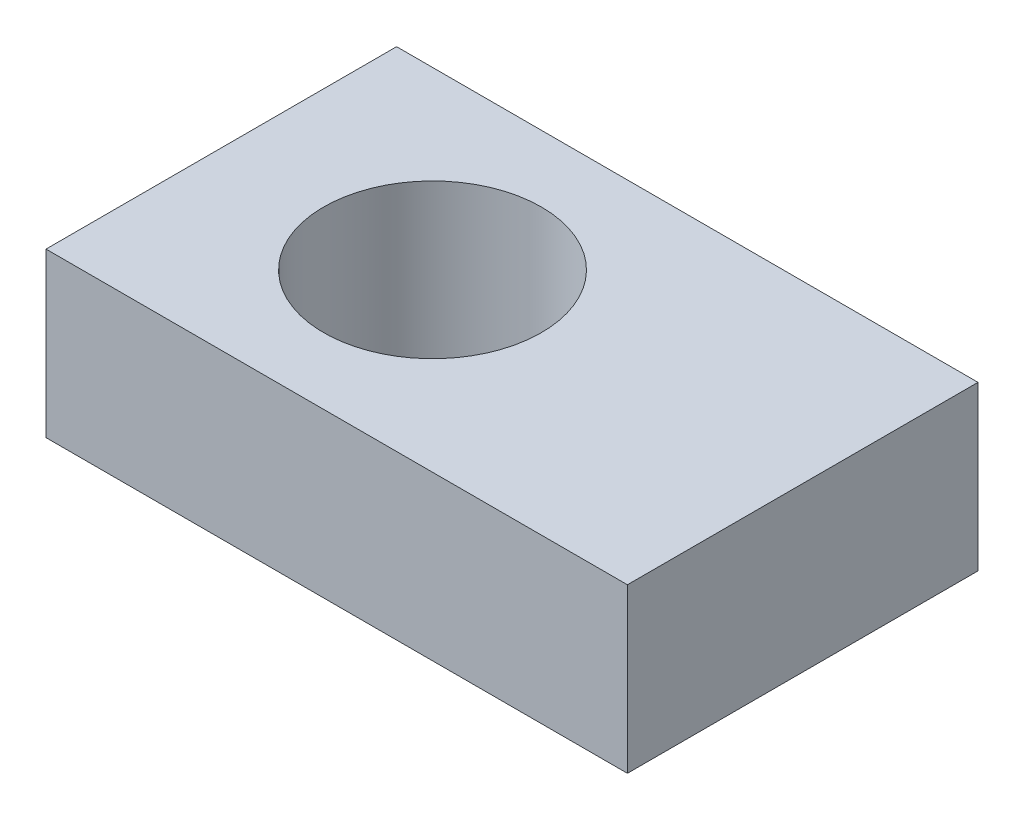
ISO-10303-21;
HEADER;
FILE_DESCRIPTION(('STEP AP214'),'2;1');
FILE_NAME('part.step','',(''),(''),'','','');
FILE_SCHEMA(('AUTOMOTIVE_DESIGN { 1 0 10303 214 1 1 1 1 }'));
ENDSEC;
DATA;
#1=APPLICATION_CONTEXT('core data for automotive mechanical design processes');
#2=APPLICATION_PROTOCOL_DEFINITION('international standard','automotive_design',2000,#1);
#3=PRODUCT_CONTEXT('',#1,'mechanical');
#4=PRODUCT('Part','Part','',(#3));
#5=PRODUCT_RELATED_PRODUCT_CATEGORY('part','',(#4));
#6=PRODUCT_DEFINITION_FORMATION('','',#4);
#7=PRODUCT_DEFINITION_CONTEXT('part definition',#1,'design');
#8=PRODUCT_DEFINITION('design','',#6,#7);
#9=PRODUCT_DEFINITION_SHAPE('','',#8);
#10=(LENGTH_UNIT() NAMED_UNIT(*) SI_UNIT(.MILLI.,.METRE.));
#11=(NAMED_UNIT(*) PLANE_ANGLE_UNIT() SI_UNIT($,.RADIAN.));
#12=(NAMED_UNIT(*) SI_UNIT($,.STERADIAN.) SOLID_ANGLE_UNIT());
#13=UNCERTAINTY_MEASURE_WITH_UNIT(LENGTH_MEASURE(1.E-05),#10,'distance_accuracy_value','');
#14=(GEOMETRIC_REPRESENTATION_CONTEXT(3) GLOBAL_UNCERTAINTY_ASSIGNED_CONTEXT((#13)) GLOBAL_UNIT_ASSIGNED_CONTEXT((#10,
#11,#12)) REPRESENTATION_CONTEXT('',''));
#15=CARTESIAN_POINT('',(0.,0.,0.));
#16=DIRECTION('',(0.,0.,1.));
#17=DIRECTION('',(1.,0.,0.));
#18=AXIS2_PLACEMENT_3D('',#15,#16,#17);
#19=CARTESIAN_POINT('',(34.43,0.02,12.38));
#20=DIRECTION('',(0.,-1.,0.));
#21=DIRECTION('',(0.,0.,-1.));
#22=AXIS2_PLACEMENT_3D('',#19,#20,#21);
#23=PLANE('',#22);
#24=CARTESIAN_POINT('',(33.7,0.0200000000000001,12.38));
#25=DIRECTION('',(0.,-1.,0.));
#26=DIRECTION('',(0.,0.,-1.));
#27=AXIS2_PLACEMENT_3D('',#24,#25,#26);
#28=CIRCLE('',#27,1.);
#29=CARTESIAN_POINT('',(33.7,0.0200000000000001,11.38));
#30=VERTEX_POINT('',#29);
#31=EDGE_CURVE('E20',#30,#30,#28,.F.);
#32=ORIENTED_EDGE('',*,*,#31,.T.);
#33=EDGE_LOOP('',(#32));
#34=FACE_BOUND('',#33,.T.);
#35=DIRECTION('',(-1.,0.,0.));
#36=VECTOR('',#35,1.);
#37=CARTESIAN_POINT('',(31.76,0.0200000000000001,10.77));
#38=LINE('',#37,#36);
#39=CARTESIAN_POINT('',(37.1,0.02,10.77));
#40=VERTEX_POINT('',#39);
#41=CARTESIAN_POINT('',(31.76,0.02,10.77));
#42=VERTEX_POINT('',#41);
#43=EDGE_CURVE('E69',#40,#42,#38,.T.);
#44=ORIENTED_EDGE('',*,*,#43,.F.);
#45=DIRECTION('',(0.,0.,-1.));
#46=VECTOR('',#45,1.);
#47=CARTESIAN_POINT('',(37.1,0.0200000000000001,10.77));
#48=LINE('',#47,#46);
#49=CARTESIAN_POINT('',(37.1,0.02,13.99));
#50=VERTEX_POINT('',#49);
#51=EDGE_CURVE('E54',#50,#40,#48,.T.);
#52=ORIENTED_EDGE('',*,*,#51,.F.);
#53=DIRECTION('',(1.,0.,0.));
#54=VECTOR('',#53,1.);
#55=CARTESIAN_POINT('',(37.1,0.0200000000000001,13.99));
#56=LINE('',#55,#54);
#57=CARTESIAN_POINT('',(31.76,0.02,13.99));
#58=VERTEX_POINT('',#57);
#59=EDGE_CURVE('E59',#58,#50,#56,.T.);
#60=ORIENTED_EDGE('',*,*,#59,.F.);
#61=DIRECTION('',(0.,0.,1.));
#62=VECTOR('',#61,1.);
#63=CARTESIAN_POINT('',(31.76,0.0200000000000001,13.99));
#64=LINE('',#63,#62);
#65=EDGE_CURVE('E82',#42,#58,#64,.T.);
#66=ORIENTED_EDGE('',*,*,#65,.F.);
#67=EDGE_LOOP('',(#44,#52,#60,#66));
#68=FACE_BOUND('',#67,.T.);
#69=ADVANCED_FACE('F17',(#34,#68),#23,.T.);
#70=CARTESIAN_POINT('',(37.1,1.52,13.99));
#71=DIRECTION('',(0.,0.,1.));
#72=DIRECTION('',(1.,0.,0.));
#73=AXIS2_PLACEMENT_3D('',#70,#71,#72);
#74=PLANE('',#73);
#75=ORIENTED_EDGE('',*,*,#59,.T.);
#76=DIRECTION('',(0.,1.,0.));
#77=VECTOR('',#76,1.);
#78=CARTESIAN_POINT('',(37.1,1.52,13.99));
#79=LINE('',#78,#77);
#80=CARTESIAN_POINT('',(37.1,1.52,13.99));
#81=VERTEX_POINT('',#80);
#82=EDGE_CURVE('E61',#81,#50,#79,.F.);
#83=ORIENTED_EDGE('',*,*,#82,.F.);
#84=DIRECTION('',(1.,0.,0.));
#85=VECTOR('',#84,1.);
#86=CARTESIAN_POINT('',(34.43,1.52,13.99));
#87=LINE('',#86,#85);
#88=CARTESIAN_POINT('',(31.76,1.52,13.99));
#89=VERTEX_POINT('',#88);
#90=EDGE_CURVE('E85',#89,#81,#87,.T.);
#91=ORIENTED_EDGE('',*,*,#90,.F.);
#92=DIRECTION('',(0.,1.,0.));
#93=VECTOR('',#92,1.);
#94=CARTESIAN_POINT('',(31.76,1.52,13.99));
#95=LINE('',#94,#93);
#96=EDGE_CURVE('E64',#58,#89,#95,.T.);
#97=ORIENTED_EDGE('',*,*,#96,.F.);
#98=EDGE_LOOP('',(#75,#83,#91,#97));
#99=FACE_BOUND('',#98,.T.);
#100=ADVANCED_FACE('F60',(#99),#74,.T.);
#101=CARTESIAN_POINT('',(37.1,1.52,10.77));
#102=DIRECTION('',(1.,0.,0.));
#103=DIRECTION('',(0.,0.,-1.));
#104=AXIS2_PLACEMENT_3D('',#101,#102,#103);
#105=PLANE('',#104);
#106=ORIENTED_EDGE('',*,*,#51,.T.);
#107=DIRECTION('',(0.,1.,0.));
#108=VECTOR('',#107,1.);
#109=CARTESIAN_POINT('',(37.1,1.52,10.77));
#110=LINE('',#109,#108);
#111=CARTESIAN_POINT('',(37.1,1.52,10.77));
#112=VERTEX_POINT('',#111);
#113=EDGE_CURVE('E71',#112,#40,#110,.F.);
#114=ORIENTED_EDGE('',*,*,#113,.F.);
#115=DIRECTION('',(0.,0.,1.));
#116=VECTOR('',#115,1.);
#117=CARTESIAN_POINT('',(37.1,1.52,12.38));
#118=LINE('',#117,#116);
#119=EDGE_CURVE('E75',#81,#112,#118,.F.);
#120=ORIENTED_EDGE('',*,*,#119,.F.);
#121=ORIENTED_EDGE('',*,*,#82,.T.);
#122=EDGE_LOOP('',(#106,#114,#120,#121));
#123=FACE_BOUND('',#122,.T.);
#124=ADVANCED_FACE('F73',(#123),#105,.T.);
#125=CARTESIAN_POINT('',(31.76,1.52,10.77));
#126=DIRECTION('',(0.,0.,-1.));
#127=DIRECTION('',(-1.,0.,0.));
#128=AXIS2_PLACEMENT_3D('',#125,#126,#127);
#129=PLANE('',#128);
#130=ORIENTED_EDGE('',*,*,#43,.T.);
#131=DIRECTION('',(0.,1.,0.));
#132=VECTOR('',#131,1.);
#133=CARTESIAN_POINT('',(31.76,1.52,10.77));
#134=LINE('',#133,#132);
#135=CARTESIAN_POINT('',(31.76,1.52,10.77));
#136=VERTEX_POINT('',#135);
#137=EDGE_CURVE('E34',#136,#42,#134,.F.);
#138=ORIENTED_EDGE('',*,*,#137,.F.);
#139=DIRECTION('',(1.,0.,0.));
#140=VECTOR('',#139,1.);
#141=CARTESIAN_POINT('',(34.43,1.52,10.77));
#142=LINE('',#141,#140);
#143=EDGE_CURVE('E88',#112,#136,#142,.F.);
#144=ORIENTED_EDGE('',*,*,#143,.F.);
#145=ORIENTED_EDGE('',*,*,#113,.T.);
#146=EDGE_LOOP('',(#130,#138,#144,#145));
#147=FACE_BOUND('',#146,.T.);
#148=ADVANCED_FACE('F98',(#147),#129,.T.);
#149=CARTESIAN_POINT('',(31.76,1.52,13.99));
#150=DIRECTION('',(-1.,0.,0.));
#151=DIRECTION('',(0.,0.,1.));
#152=AXIS2_PLACEMENT_3D('',#149,#150,#151);
#153=PLANE('',#152);
#154=ORIENTED_EDGE('',*,*,#65,.T.);
#155=ORIENTED_EDGE('',*,*,#96,.T.);
#156=DIRECTION('',(0.,0.,1.));
#157=VECTOR('',#156,1.);
#158=CARTESIAN_POINT('',(31.76,1.52,12.38));
#159=LINE('',#158,#157);
#160=EDGE_CURVE('E26',#136,#89,#159,.T.);
#161=ORIENTED_EDGE('',*,*,#160,.F.);
#162=ORIENTED_EDGE('',*,*,#137,.T.);
#163=EDGE_LOOP('',(#154,#155,#161,#162));
#164=FACE_BOUND('',#163,.T.);
#165=ADVANCED_FACE('F95',(#164),#153,.T.);
#166=CARTESIAN_POINT('',(33.7,1.52,12.38));
#167=DIRECTION('',(0.,-1.,0.));
#168=DIRECTION('',(0.,0.,-1.));
#169=AXIS2_PLACEMENT_3D('',#166,#167,#168);
#170=CYLINDRICAL_SURFACE('',#169,1.);
#171=ORIENTED_EDGE('',*,*,#31,.F.);
#172=EDGE_LOOP('',(#171));
#173=FACE_BOUND('',#172,.T.);
#174=CARTESIAN_POINT('',(33.7,1.52,12.38));
#175=DIRECTION('',(0.,-1.,0.));
#176=DIRECTION('',(0.,0.,-1.));
#177=AXIS2_PLACEMENT_3D('',#174,#175,#176);
#178=CIRCLE('',#177,1.);
#179=CARTESIAN_POINT('',(33.7,1.52,11.38));
#180=VERTEX_POINT('',#179);
#181=EDGE_CURVE('E11',#180,#180,#178,.T.);
#182=ORIENTED_EDGE('',*,*,#181,.F.);
#183=EDGE_LOOP('',(#182));
#184=FACE_BOUND('',#183,.T.);
#185=ADVANCED_FACE('F97',(#173,#184),#170,.F.);
#186=CARTESIAN_POINT('',(34.43,1.52,12.38));
#187=DIRECTION('',(0.,1.,0.));
#188=DIRECTION('',(0.,0.,1.));
#189=AXIS2_PLACEMENT_3D('',#186,#187,#188);
#190=PLANE('',#189);
#191=ORIENTED_EDGE('',*,*,#181,.T.);
#192=EDGE_LOOP('',(#191));
#193=FACE_BOUND('',#192,.T.);
#194=ORIENTED_EDGE('',*,*,#143,.T.);
#195=ORIENTED_EDGE('',*,*,#160,.T.);
#196=ORIENTED_EDGE('',*,*,#90,.T.);
#197=ORIENTED_EDGE('',*,*,#119,.T.);
#198=EDGE_LOOP('',(#194,#195,#196,#197));
#199=FACE_BOUND('',#198,.T.);
#200=ADVANCED_FACE('F93',(#193,#199),#190,.T.);
#201=CLOSED_SHELL('',(#69,#100,#124,#148,#165,#185,#200));
#202=MANIFOLD_SOLID_BREP('B1',#201);
#203=ADVANCED_BREP_SHAPE_REPRESENTATION('',(#18,#202),#14);
#204=SHAPE_DEFINITION_REPRESENTATION(#9,#203);
ENDSEC;
END-ISO-10303-21;
